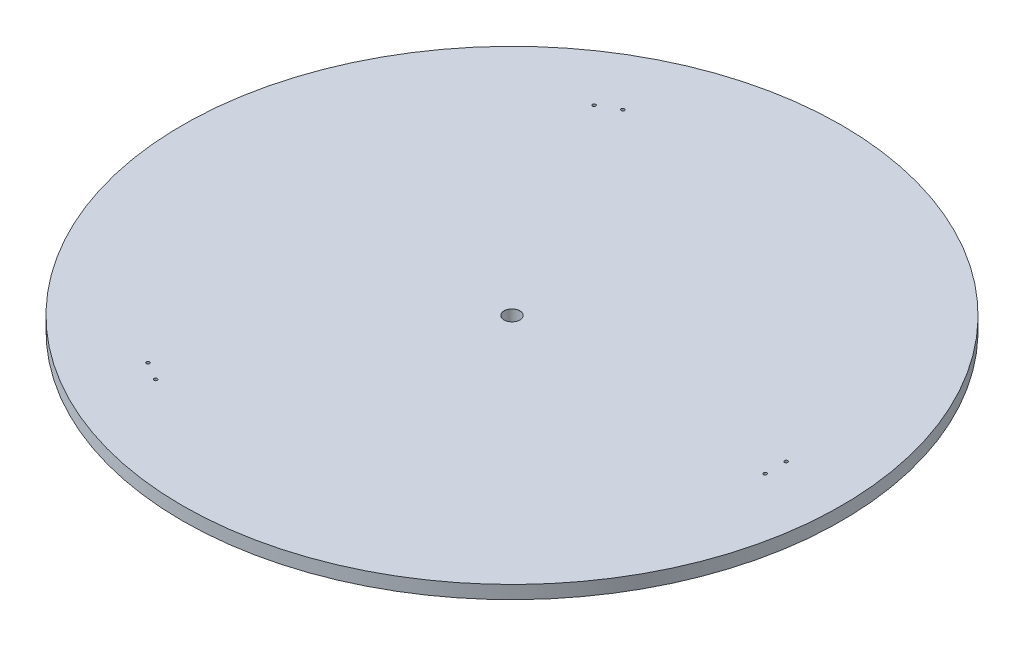
ISO-10303-21;
HEADER;
FILE_DESCRIPTION(('STEP AP214'),'2;1');
FILE_NAME('part.step','',(''),(''),'','','');
FILE_SCHEMA(('AUTOMOTIVE_DESIGN { 1 0 10303 214 1 1 1 1 }'));
ENDSEC;
DATA;
#1=APPLICATION_CONTEXT('core data for automotive mechanical design processes');
#2=APPLICATION_PROTOCOL_DEFINITION('international standard','automotive_design',2000,#1);
#3=PRODUCT_CONTEXT('',#1,'mechanical');
#4=PRODUCT('Part','Part','',(#3));
#5=PRODUCT_RELATED_PRODUCT_CATEGORY('part','',(#4));
#6=PRODUCT_DEFINITION_FORMATION('','',#4);
#7=PRODUCT_DEFINITION_CONTEXT('part definition',#1,'design');
#8=PRODUCT_DEFINITION('design','',#6,#7);
#9=PRODUCT_DEFINITION_SHAPE('','',#8);
#10=(LENGTH_UNIT() NAMED_UNIT(*) SI_UNIT(.MILLI.,.METRE.));
#11=(NAMED_UNIT(*) PLANE_ANGLE_UNIT() SI_UNIT($,.RADIAN.));
#12=(NAMED_UNIT(*) SI_UNIT($,.STERADIAN.) SOLID_ANGLE_UNIT());
#13=UNCERTAINTY_MEASURE_WITH_UNIT(LENGTH_MEASURE(1.E-05),#10,'distance_accuracy_value','');
#14=(GEOMETRIC_REPRESENTATION_CONTEXT(3) GLOBAL_UNCERTAINTY_ASSIGNED_CONTEXT((#13)) GLOBAL_UNIT_ASSIGNED_CONTEXT((#10,
#11,#12)) REPRESENTATION_CONTEXT('',''));
#15=CARTESIAN_POINT('',(0.,0.,0.));
#16=DIRECTION('',(0.,0.,1.));
#17=DIRECTION('',(1.,0.,0.));
#18=AXIS2_PLACEMENT_3D('',#15,#16,#17);
#19=CARTESIAN_POINT('',(0.,5.,0.));
#20=DIRECTION('',(0.,-1.,0.));
#21=DIRECTION('',(0.,0.,-1.));
#22=AXIS2_PLACEMENT_3D('',#19,#20,#21);
#23=CYLINDRICAL_SURFACE('',#22,250.);
#24=CARTESIAN_POINT('',(0.,5.,0.));
#25=DIRECTION('',(0.,1.,0.));
#26=DIRECTION('',(0.,0.,1.));
#27=AXIS2_PLACEMENT_3D('',#24,#25,#26);
#28=CIRCLE('',#27,250.);
#29=CARTESIAN_POINT('',(0.,5.,250.));
#30=VERTEX_POINT('',#29);
#31=EDGE_CURVE('E10',#30,#30,#28,.T.);
#32=ORIENTED_EDGE('',*,*,#31,.F.);
#33=EDGE_LOOP('',(#32));
#34=FACE_BOUND('',#33,.T.);
#35=CARTESIAN_POINT('',(0.,-5.,0.));
#36=DIRECTION('',(0.,1.,0.));
#37=DIRECTION('',(0.,0.,1.));
#38=AXIS2_PLACEMENT_3D('',#35,#36,#37);
#39=CIRCLE('',#38,250.);
#40=CARTESIAN_POINT('',(0.,-5.,250.));
#41=VERTEX_POINT('',#40);
#42=EDGE_CURVE('E46',#41,#41,#39,.T.);
#43=ORIENTED_EDGE('',*,*,#42,.T.);
#44=EDGE_LOOP('',(#43));
#45=FACE_BOUND('',#44,.T.);
#46=ADVANCED_FACE('F43',(#34,#45),#23,.T.);
#47=CARTESIAN_POINT('',(0.,5.,0.));
#48=DIRECTION('',(0.,1.,0.));
#49=DIRECTION('',(0.,0.,1.));
#50=AXIS2_PLACEMENT_3D('',#47,#48,#49);
#51=PLANE('',#50);
#52=CARTESIAN_POINT('',(-93.0717967697253,5.,177.205080756887));
#53=DIRECTION('',(0.,1.,0.));
#54=DIRECTION('',(-0.866025403784436,0.,-0.500000000000004));
#55=AXIS2_PLACEMENT_3D('',#52,#53,#54);
#56=CIRCLE('',#55,1.24999999999995);
#57=CARTESIAN_POINT('',(-94.1543285244558,5.,176.580080756887));
#58=VERTEX_POINT('',#57);
#59=EDGE_CURVE('E109',#58,#58,#56,.T.);
#60=ORIENTED_EDGE('',*,*,#59,.F.);
#61=EDGE_LOOP('',(#60));
#62=FACE_BOUND('',#61,.T.);
#63=CARTESIAN_POINT('',(-106.928203230276,5.,169.205080756887));
#64=DIRECTION('',(0.,1.,0.));
#65=DIRECTION('',(0.866025403784436,0.,0.500000000000004));
#66=AXIS2_PLACEMENT_3D('',#63,#64,#65);
#67=CIRCLE('',#66,1.24999999999995);
#68=CARTESIAN_POINT('',(-105.845671475546,5.,169.830080756887));
#69=VERTEX_POINT('',#68);
#70=EDGE_CURVE('E101',#69,#69,#67,.T.);
#71=ORIENTED_EDGE('',*,*,#70,.F.);
#72=EDGE_LOOP('',(#71));
#73=FACE_BOUND('',#72,.T.);
#74=CARTESIAN_POINT('',(-106.928203230274,5.,-169.205080756889));
#75=DIRECTION('',(0.,1.,0.));
#76=DIRECTION('',(0.866025403784443,0.,-0.499999999999992));
#77=AXIS2_PLACEMENT_3D('',#74,#75,#76);
#78=CIRCLE('',#77,1.24999999999995);
#79=CARTESIAN_POINT('',(-105.845671475543,5.,-169.830080756889));
#80=VERTEX_POINT('',#79);
#81=EDGE_CURVE('E93',#80,#80,#78,.T.);
#82=ORIENTED_EDGE('',*,*,#81,.F.);
#83=EDGE_LOOP('',(#82));
#84=FACE_BOUND('',#83,.T.);
#85=CARTESIAN_POINT('',(-93.0717967697229,5.,-177.205080756889));
#86=DIRECTION('',(0.,1.,0.));
#87=DIRECTION('',(-0.866025403784443,0.,0.499999999999992));
#88=AXIS2_PLACEMENT_3D('',#85,#86,#87);
#89=CIRCLE('',#88,1.24999999999995);
#90=CARTESIAN_POINT('',(-94.1543285244534,5.,-176.580080756889));
#91=VERTEX_POINT('',#90);
#92=EDGE_CURVE('E85',#91,#91,#89,.T.);
#93=ORIENTED_EDGE('',*,*,#92,.F.);
#94=EDGE_LOOP('',(#93));
#95=FACE_BOUND('',#94,.T.);
#96=CARTESIAN_POINT('',(200.,5.,-8.));
#97=DIRECTION('',(0.,1.,0.));
#98=DIRECTION('',(0.,0.,1.));
#99=AXIS2_PLACEMENT_3D('',#96,#97,#98);
#100=CIRCLE('',#99,1.24999999999995);
#101=CARTESIAN_POINT('',(200.,5.,-6.75000000000005));
#102=VERTEX_POINT('',#101);
#103=EDGE_CURVE('E78',#102,#102,#100,.T.);
#104=ORIENTED_EDGE('',*,*,#103,.F.);
#105=EDGE_LOOP('',(#104));
#106=FACE_BOUND('',#105,.T.);
#107=CARTESIAN_POINT('',(200.,5.,8.));
#108=DIRECTION('',(0.,1.,0.));
#109=DIRECTION('',(0.,0.,-1.));
#110=AXIS2_PLACEMENT_3D('',#107,#108,#109);
#111=CIRCLE('',#110,1.24999999999995);
#112=CARTESIAN_POINT('',(200.,5.,6.75000000000005));
#113=VERTEX_POINT('',#112);
#114=EDGE_CURVE('E73',#113,#113,#111,.T.);
#115=ORIENTED_EDGE('',*,*,#114,.F.);
#116=EDGE_LOOP('',(#115));
#117=FACE_BOUND('',#116,.T.);
#118=CARTESIAN_POINT('',(0.,5.,0.));
#119=DIRECTION('',(0.,1.,0.));
#120=DIRECTION('',(0.,0.,1.));
#121=AXIS2_PLACEMENT_3D('',#118,#119,#120);
#122=CIRCLE('',#121,6.025);
#123=CARTESIAN_POINT('',(0.,5.,6.025));
#124=VERTEX_POINT('',#123);
#125=EDGE_CURVE('E64',#124,#124,#122,.T.);
#126=ORIENTED_EDGE('',*,*,#125,.F.);
#127=EDGE_LOOP('',(#126));
#128=FACE_BOUND('',#127,.T.);
#129=ORIENTED_EDGE('',*,*,#31,.T.);
#130=EDGE_LOOP('',(#129));
#131=FACE_BOUND('',#130,.T.);
#132=ADVANCED_FACE('F127',(#62,#73,#84,#95,#106,#117,#128,#131),#51,.T.);
#133=CARTESIAN_POINT('',(0.,-5.,0.));
#134=DIRECTION('',(0.,1.,0.));
#135=DIRECTION('',(0.,0.,1.));
#136=AXIS2_PLACEMENT_3D('',#133,#134,#135);
#137=PLANE('',#136);
#138=CARTESIAN_POINT('',(-93.0717967697253,-5.,177.205080756887));
#139=DIRECTION('',(0.,1.,0.));
#140=DIRECTION('',(-0.866025403784436,0.,-0.500000000000004));
#141=AXIS2_PLACEMENT_3D('',#138,#139,#140);
#142=CIRCLE('',#141,1.24999999999995);
#143=CARTESIAN_POINT('',(-94.1543285244558,-5.,176.580080756887));
#144=VERTEX_POINT('',#143);
#145=EDGE_CURVE('E74',#144,#144,#142,.T.);
#146=ORIENTED_EDGE('',*,*,#145,.T.);
#147=EDGE_LOOP('',(#146));
#148=FACE_BOUND('',#147,.T.);
#149=CARTESIAN_POINT('',(-106.928203230276,-5.,169.205080756887));
#150=DIRECTION('',(0.,1.,0.));
#151=DIRECTION('',(0.866025403784436,0.,0.500000000000004));
#152=AXIS2_PLACEMENT_3D('',#149,#150,#151);
#153=CIRCLE('',#152,1.24999999999995);
#154=CARTESIAN_POINT('',(-105.845671475546,-5.,169.830080756887));
#155=VERTEX_POINT('',#154);
#156=EDGE_CURVE('E105',#155,#155,#153,.T.);
#157=ORIENTED_EDGE('',*,*,#156,.T.);
#158=EDGE_LOOP('',(#157));
#159=FACE_BOUND('',#158,.T.);
#160=CARTESIAN_POINT('',(-106.928203230274,-5.,-169.205080756889));
#161=DIRECTION('',(0.,1.,0.));
#162=DIRECTION('',(0.866025403784443,0.,-0.499999999999992));
#163=AXIS2_PLACEMENT_3D('',#160,#161,#162);
#164=CIRCLE('',#163,1.24999999999995);
#165=CARTESIAN_POINT('',(-105.845671475543,-5.,-169.830080756889));
#166=VERTEX_POINT('',#165);
#167=EDGE_CURVE('E97',#166,#166,#164,.T.);
#168=ORIENTED_EDGE('',*,*,#167,.T.);
#169=EDGE_LOOP('',(#168));
#170=FACE_BOUND('',#169,.T.);
#171=CARTESIAN_POINT('',(-93.0717967697229,-5.,-177.205080756889));
#172=DIRECTION('',(0.,1.,0.));
#173=DIRECTION('',(-0.866025403784443,0.,0.499999999999992));
#174=AXIS2_PLACEMENT_3D('',#171,#172,#173);
#175=CIRCLE('',#174,1.24999999999995);
#176=CARTESIAN_POINT('',(-94.1543285244534,-5.,-176.580080756889));
#177=VERTEX_POINT('',#176);
#178=EDGE_CURVE('E89',#177,#177,#175,.T.);
#179=ORIENTED_EDGE('',*,*,#178,.T.);
#180=EDGE_LOOP('',(#179));
#181=FACE_BOUND('',#180,.T.);
#182=CARTESIAN_POINT('',(200.,-5.,-8.));
#183=DIRECTION('',(0.,1.,0.));
#184=DIRECTION('',(0.,0.,1.));
#185=AXIS2_PLACEMENT_3D('',#182,#183,#184);
#186=CIRCLE('',#185,1.24999999999995);
#187=CARTESIAN_POINT('',(200.,-5.,-6.75000000000005));
#188=VERTEX_POINT('',#187);
#189=EDGE_CURVE('E68',#188,#188,#186,.T.);
#190=ORIENTED_EDGE('',*,*,#189,.T.);
#191=EDGE_LOOP('',(#190));
#192=FACE_BOUND('',#191,.T.);
#193=CARTESIAN_POINT('',(200.,-5.,8.));
#194=DIRECTION('',(0.,1.,0.));
#195=DIRECTION('',(0.,0.,-1.));
#196=AXIS2_PLACEMENT_3D('',#193,#194,#195);
#197=CIRCLE('',#196,1.24999999999995);
#198=CARTESIAN_POINT('',(200.,-5.,6.75000000000005));
#199=VERTEX_POINT('',#198);
#200=EDGE_CURVE('E69',#199,#199,#197,.T.);
#201=ORIENTED_EDGE('',*,*,#200,.T.);
#202=EDGE_LOOP('',(#201));
#203=FACE_BOUND('',#202,.T.);
#204=CARTESIAN_POINT('',(0.,-5.,0.));
#205=DIRECTION('',(0.,1.,0.));
#206=DIRECTION('',(0.,0.,1.));
#207=AXIS2_PLACEMENT_3D('',#204,#205,#206);
#208=CIRCLE('',#207,6.);
#209=CARTESIAN_POINT('',(0.,-5.,6.));
#210=VERTEX_POINT('',#209);
#211=EDGE_CURVE('E55',#210,#210,#208,.T.);
#212=ORIENTED_EDGE('',*,*,#211,.T.);
#213=EDGE_LOOP('',(#212));
#214=FACE_BOUND('',#213,.T.);
#215=ORIENTED_EDGE('',*,*,#42,.F.);
#216=EDGE_LOOP('',(#215));
#217=FACE_BOUND('',#216,.T.);
#218=ADVANCED_FACE('F117',(#148,#159,#170,#181,#192,#203,#214,#217),#137,.F.);
#219=CARTESIAN_POINT('',(0.,5.,0.));
#220=DIRECTION('',(0.,1.,0.));
#221=DIRECTION('',(0.,0.,1.));
#222=AXIS2_PLACEMENT_3D('',#219,#220,#221);
#223=CYLINDRICAL_SURFACE('',#222,5.99999999999999);
#224=ORIENTED_EDGE('',*,*,#211,.F.);
#225=EDGE_LOOP('',(#224));
#226=FACE_BOUND('',#225,.T.);
#227=CARTESIAN_POINT('',(0.,4.975,0.));
#228=DIRECTION('',(0.,1.,0.));
#229=DIRECTION('',(0.,0.,1.));
#230=AXIS2_PLACEMENT_3D('',#227,#228,#229);
#231=CIRCLE('',#230,5.99999999999999);
#232=CARTESIAN_POINT('',(0.,4.975,5.99999999999999));
#233=VERTEX_POINT('',#232);
#234=EDGE_CURVE('E60',#233,#233,#231,.T.);
#235=ORIENTED_EDGE('',*,*,#234,.T.);
#236=EDGE_LOOP('',(#235));
#237=FACE_BOUND('',#236,.T.);
#238=ADVANCED_FACE('F146',(#226,#237),#223,.F.);
#239=CARTESIAN_POINT('',(0.,5.,0.));
#240=DIRECTION('',(0.,1.,0.));
#241=DIRECTION('',(0.,0.,1.));
#242=AXIS2_PLACEMENT_3D('',#239,#240,#241);
#243=CONICAL_SURFACE('',#242,6.025,0.785398163397743);
#244=ORIENTED_EDGE('',*,*,#234,.F.);
#245=EDGE_LOOP('',(#244));
#246=FACE_BOUND('',#245,.T.);
#247=ORIENTED_EDGE('',*,*,#125,.T.);
#248=EDGE_LOOP('',(#247));
#249=FACE_BOUND('',#248,.T.);
#250=ADVANCED_FACE('F143',(#246,#249),#243,.F.);
#251=CARTESIAN_POINT('',(200.,-5.,8.));
#252=DIRECTION('',(0.,1.,0.));
#253=DIRECTION('',(0.,0.,1.));
#254=AXIS2_PLACEMENT_3D('',#251,#252,#253);
#255=CYLINDRICAL_SURFACE('',#254,1.24999999999995);
#256=ORIENTED_EDGE('',*,*,#200,.F.);
#257=EDGE_LOOP('',(#256));
#258=FACE_BOUND('',#257,.T.);
#259=ORIENTED_EDGE('',*,*,#114,.T.);
#260=EDGE_LOOP('',(#259));
#261=FACE_BOUND('',#260,.T.);
#262=ADVANCED_FACE('F145',(#258,#261),#255,.F.);
#263=CARTESIAN_POINT('',(200.,-5.,-8.));
#264=DIRECTION('',(0.,1.,0.));
#265=DIRECTION('',(0.,0.,1.));
#266=AXIS2_PLACEMENT_3D('',#263,#264,#265);
#267=CYLINDRICAL_SURFACE('',#266,1.24999999999995);
#268=ORIENTED_EDGE('',*,*,#189,.F.);
#269=EDGE_LOOP('',(#268));
#270=FACE_BOUND('',#269,.T.);
#271=ORIENTED_EDGE('',*,*,#103,.T.);
#272=EDGE_LOOP('',(#271));
#273=FACE_BOUND('',#272,.T.);
#274=ADVANCED_FACE('F153',(#270,#273),#267,.F.);
#275=CARTESIAN_POINT('',(-93.0717967697229,-5.,-177.205080756889));
#276=DIRECTION('',(0.,1.,0.));
#277=DIRECTION('',(0.,0.,1.));
#278=AXIS2_PLACEMENT_3D('',#275,#276,#277);
#279=CYLINDRICAL_SURFACE('',#278,1.24999999999995);
#280=ORIENTED_EDGE('',*,*,#178,.F.);
#281=EDGE_LOOP('',(#280));
#282=FACE_BOUND('',#281,.T.);
#283=ORIENTED_EDGE('',*,*,#92,.T.);
#284=EDGE_LOOP('',(#283));
#285=FACE_BOUND('',#284,.T.);
#286=ADVANCED_FACE('F177',(#282,#285),#279,.F.);
#287=CARTESIAN_POINT('',(-106.928203230274,-5.,-169.205080756889));
#288=DIRECTION('',(0.,1.,0.));
#289=DIRECTION('',(0.,0.,1.));
#290=AXIS2_PLACEMENT_3D('',#287,#288,#289);
#291=CYLINDRICAL_SURFACE('',#290,1.24999999999995);
#292=ORIENTED_EDGE('',*,*,#167,.F.);
#293=EDGE_LOOP('',(#292));
#294=FACE_BOUND('',#293,.T.);
#295=ORIENTED_EDGE('',*,*,#81,.T.);
#296=EDGE_LOOP('',(#295));
#297=FACE_BOUND('',#296,.T.);
#298=ADVANCED_FACE('F181',(#294,#297),#291,.F.);
#299=CARTESIAN_POINT('',(-106.928203230276,-5.,169.205080756887));
#300=DIRECTION('',(0.,1.,0.));
#301=DIRECTION('',(0.,0.,1.));
#302=AXIS2_PLACEMENT_3D('',#299,#300,#301);
#303=CYLINDRICAL_SURFACE('',#302,1.24999999999995);
#304=ORIENTED_EDGE('',*,*,#156,.F.);
#305=EDGE_LOOP('',(#304));
#306=FACE_BOUND('',#305,.T.);
#307=ORIENTED_EDGE('',*,*,#70,.T.);
#308=EDGE_LOOP('',(#307));
#309=FACE_BOUND('',#308,.T.);
#310=ADVANCED_FACE('F123',(#306,#309),#303,.F.);
#311=CARTESIAN_POINT('',(-93.0717967697253,-5.,177.205080756887));
#312=DIRECTION('',(0.,1.,0.));
#313=DIRECTION('',(0.,0.,1.));
#314=AXIS2_PLACEMENT_3D('',#311,#312,#313);
#315=CYLINDRICAL_SURFACE('',#314,1.24999999999995);
#316=ORIENTED_EDGE('',*,*,#145,.F.);
#317=EDGE_LOOP('',(#316));
#318=FACE_BOUND('',#317,.T.);
#319=ORIENTED_EDGE('',*,*,#59,.T.);
#320=EDGE_LOOP('',(#319));
#321=FACE_BOUND('',#320,.T.);
#322=ADVANCED_FACE('F120',(#318,#321),#315,.F.);
#323=CLOSED_SHELL('',(#46,#132,#218,#238,#250,#262,#274,#286,#298,#310,#322));
#324=MANIFOLD_SOLID_BREP('B2',#323);
#325=ADVANCED_BREP_SHAPE_REPRESENTATION('',(#18,#324),#14);
#326=SHAPE_DEFINITION_REPRESENTATION(#9,#325);
ENDSEC;
END-ISO-10303-21;
